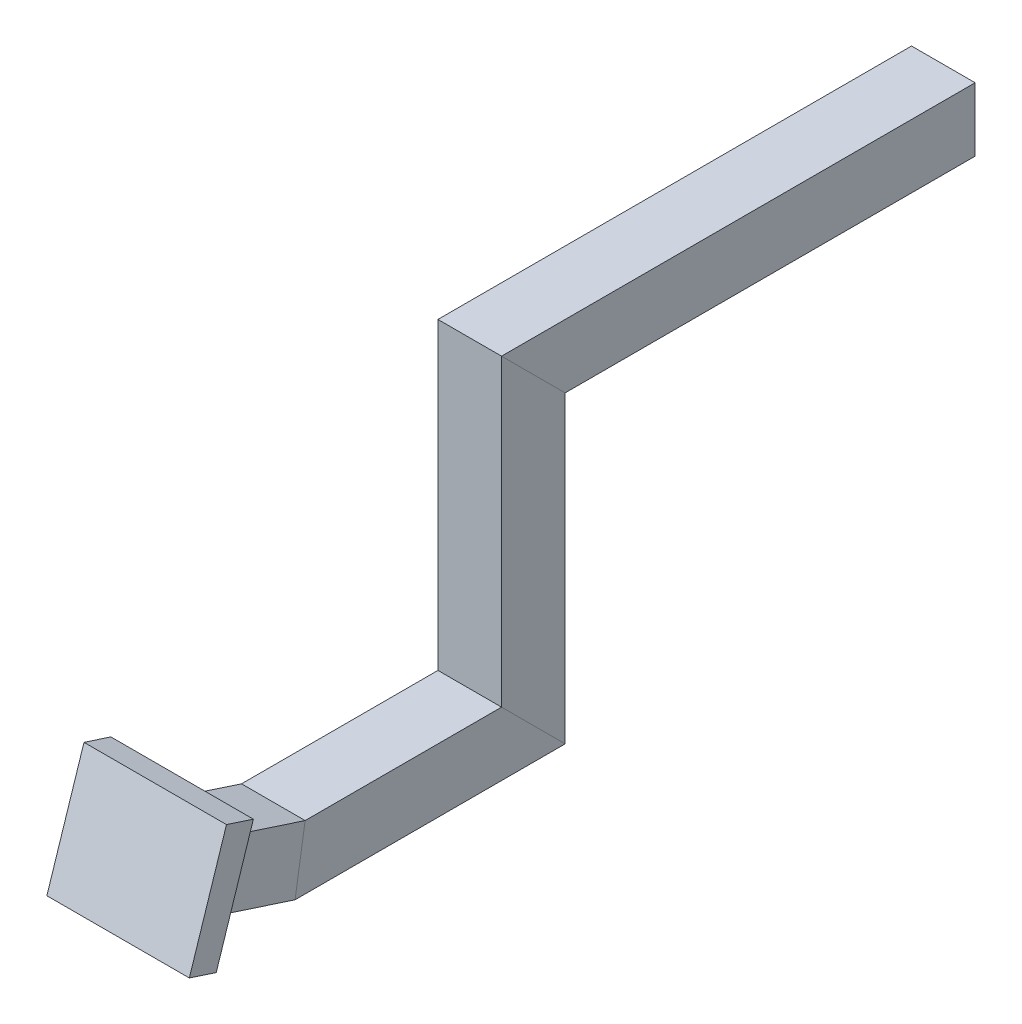
ISO-10303-21;
HEADER;
FILE_DESCRIPTION(('STEP AP214'),'2;1');
FILE_NAME('part.step','',(''),(''),'','','');
FILE_SCHEMA(('AUTOMOTIVE_DESIGN { 1 0 10303 214 1 1 1 1 }'));
ENDSEC;
DATA;
#1=APPLICATION_CONTEXT('core data for automotive mechanical design processes');
#2=APPLICATION_PROTOCOL_DEFINITION('international standard','automotive_design',2000,#1);
#3=PRODUCT_CONTEXT('',#1,'mechanical');
#4=PRODUCT('Part','Part','',(#3));
#5=PRODUCT_RELATED_PRODUCT_CATEGORY('part','',(#4));
#6=PRODUCT_DEFINITION_FORMATION('','',#4);
#7=PRODUCT_DEFINITION_CONTEXT('part definition',#1,'design');
#8=PRODUCT_DEFINITION('design','',#6,#7);
#9=PRODUCT_DEFINITION_SHAPE('','',#8);
#10=(LENGTH_UNIT() NAMED_UNIT(*) SI_UNIT(.MILLI.,.METRE.));
#11=(NAMED_UNIT(*) PLANE_ANGLE_UNIT() SI_UNIT($,.RADIAN.));
#12=(NAMED_UNIT(*) SI_UNIT($,.STERADIAN.) SOLID_ANGLE_UNIT());
#13=UNCERTAINTY_MEASURE_WITH_UNIT(LENGTH_MEASURE(1.E-05),#10,'distance_accuracy_value','');
#14=(GEOMETRIC_REPRESENTATION_CONTEXT(3) GLOBAL_UNCERTAINTY_ASSIGNED_CONTEXT((#13)) GLOBAL_UNIT_ASSIGNED_CONTEXT((#10,
#11,#12)) REPRESENTATION_CONTEXT('',''));
#15=CARTESIAN_POINT('',(0.,0.,0.));
#16=DIRECTION('',(0.,0.,1.));
#17=DIRECTION('',(1.,0.,0.));
#18=AXIS2_PLACEMENT_3D('',#15,#16,#17);
#19=CARTESIAN_POINT('',(125.720904946327,61.5947103502472,111.01473929286));
#20=DIRECTION('',(-1.,0.,0.));
#21=DIRECTION('',(0.,0.,1.));
#22=AXIS2_PLACEMENT_3D('',#19,#20,#21);
#23=PLANE('',#22);
#24=DIRECTION('',(0.,0.987688340595138,-0.156434465040228));
#25=VECTOR('',#24,1.);
#26=CARTESIAN_POINT('',(125.720904946327,67.8570534503429,111.619614546898));
#27=LINE('',#26,#25);
#28=CARTESIAN_POINT('',(125.720904946327,53.0881279706955,113.958782543186));
#29=VERTEX_POINT('',#28);
#30=CARTESIAN_POINT('',(125.720904946327,62.0881279706955,112.533322580265));
#31=VERTEX_POINT('',#30);
#32=EDGE_CURVE('E149',#29,#31,#27,.T.);
#33=ORIENTED_EDGE('',*,*,#32,.F.);
#34=DIRECTION('',(0.,0.309016994374942,0.951056516295155));
#35=VECTOR('',#34,1.);
#36=CARTESIAN_POINT('',(125.720904946327,53.0352017035908,113.795892242234));
#37=LINE('',#36,#35);
#38=CARTESIAN_POINT('',(125.720904946327,56.3985435911167,124.147194199365));
#39=VERTEX_POINT('',#38);
#40=EDGE_CURVE('E102',#29,#39,#37,.T.);
#41=ORIENTED_EDGE('',*,*,#40,.T.);
#42=DIRECTION('',(0.,-0.951056516295155,0.309016994374942));
#43=VECTOR('',#42,1.);
#44=CARTESIAN_POINT('',(125.720904946327,64.9580522377731,121.36604124999));
#45=LINE('',#44,#43);
#46=CARTESIAN_POINT('',(125.720904946327,64.9580522377731,121.36604124999));
#47=VERTEX_POINT('',#46);
#48=EDGE_CURVE('E153',#47,#39,#45,.T.);
#49=ORIENTED_EDGE('',*,*,#48,.F.);
#50=DIRECTION('',(0.,0.309016994374942,0.951056516295155));
#51=VECTOR('',#50,1.);
#52=CARTESIAN_POINT('',(125.720904946327,61.5947103502472,111.01473929286));
#53=LINE('',#52,#51);
#54=EDGE_CURVE('E45',#31,#47,#53,.T.);
#55=ORIENTED_EDGE('',*,*,#54,.F.);
#56=EDGE_LOOP('',(#33,#41,#49,#55));
#57=FACE_BOUND('',#56,.T.);
#58=ADVANCED_FACE('F41',(#57),#23,.T.);
#59=CARTESIAN_POINT('',(125.720904946327,53.0352017035908,113.795892242234));
#60=DIRECTION('',(0.,-0.951056516295155,0.309016994374942));
#61=DIRECTION('',(0.,-0.309016994374942,-0.951056516295155));
#62=AXIS2_PLACEMENT_3D('',#59,#60,#61);
#63=PLANE('',#62);
#64=DIRECTION('',(-1.,0.,0.));
#65=VECTOR('',#64,1.);
#66=CARTESIAN_POINT('',(125.720904946327,53.0881279706955,113.958782543186));
#67=LINE('',#66,#65);
#68=CARTESIAN_POINT('',(134.720904946327,53.0881279706955,113.958782543186));
#69=VERTEX_POINT('',#68);
#70=EDGE_CURVE('E93',#69,#29,#67,.T.);
#71=ORIENTED_EDGE('',*,*,#70,.F.);
#72=DIRECTION('',(0.,0.309016994374942,0.951056516295155));
#73=VECTOR('',#72,1.);
#74=CARTESIAN_POINT('',(134.720904946327,53.0352017035908,113.795892242234));
#75=LINE('',#74,#73);
#76=CARTESIAN_POINT('',(134.720904946327,57.6346115686165,127.951420264545));
#77=VERTEX_POINT('',#76);
#78=EDGE_CURVE('E98',#69,#77,#75,.T.);
#79=ORIENTED_EDGE('',*,*,#78,.T.);
#80=DIRECTION('',(1.,0.,0.));
#81=VECTOR('',#80,1.);
#82=CARTESIAN_POINT('',(118.72090346,57.6346115686165,127.951420264545));
#83=LINE('',#82,#81);
#84=CARTESIAN_POINT('',(118.72090346,57.6346115686165,127.951420264545));
#85=VERTEX_POINT('',#84);
#86=EDGE_CURVE('E191',#85,#77,#83,.T.);
#87=ORIENTED_EDGE('',*,*,#86,.F.);
#88=DIRECTION('',(0.,-0.309016994374943,-0.951056516295155));
#89=VECTOR('',#88,1.);
#90=CARTESIAN_POINT('',(118.72090346,57.6346115686165,127.951420264545));
#91=LINE('',#90,#89);
#92=CARTESIAN_POINT('',(118.72090346,56.3985435911167,124.147194199365));
#93=VERTEX_POINT('',#92);
#94=EDGE_CURVE('E196',#85,#93,#91,.T.);
#95=ORIENTED_EDGE('',*,*,#94,.T.);
#96=DIRECTION('',(1.,0.,0.));
#97=VECTOR('',#96,1.);
#98=CARTESIAN_POINT('',(118.72090346,56.3985435911167,124.147194199365));
#99=LINE('',#98,#97);
#100=EDGE_CURVE('E185',#93,#39,#99,.T.);
#101=ORIENTED_EDGE('',*,*,#100,.T.);
#102=ORIENTED_EDGE('',*,*,#40,.F.);
#103=EDGE_LOOP('',(#71,#79,#87,#95,#101,#102));
#104=FACE_BOUND('',#103,.T.);
#105=ADVANCED_FACE('F95',(#104),#63,.T.);
#106=CARTESIAN_POINT('',(134.720904946327,61.5947103502472,111.01473929286));
#107=DIRECTION('',(1.,0.,0.));
#108=DIRECTION('',(0.,0.,-1.));
#109=AXIS2_PLACEMENT_3D('',#106,#107,#108);
#110=PLANE('',#109);
#111=DIRECTION('',(0.,-0.987688340595138,0.156434465040228));
#112=VECTOR('',#111,1.);
#113=CARTESIAN_POINT('',(134.720904946327,67.8570534503429,111.619614546898));
#114=LINE('',#113,#112);
#115=CARTESIAN_POINT('',(134.720904946327,62.0881279706955,112.533322580265));
#116=VERTEX_POINT('',#115);
#117=EDGE_CURVE('E109',#116,#69,#114,.T.);
#118=ORIENTED_EDGE('',*,*,#117,.F.);
#119=DIRECTION('',(0.,0.309016994374942,0.951056516295155));
#120=VECTOR('',#119,1.);
#121=CARTESIAN_POINT('',(134.720904946327,61.5947103502472,111.01473929286));
#122=LINE('',#121,#120);
#123=CARTESIAN_POINT('',(134.720904946327,66.1941202152729,125.170267315171));
#124=VERTEX_POINT('',#123);
#125=EDGE_CURVE('E120',#116,#124,#122,.T.);
#126=ORIENTED_EDGE('',*,*,#125,.T.);
#127=DIRECTION('',(0.,0.951056516295155,-0.309016994374942));
#128=VECTOR('',#127,1.);
#129=CARTESIAN_POINT('',(134.720904946327,66.1941202152729,125.170267315171));
#130=LINE('',#129,#128);
#131=EDGE_CURVE('E117',#77,#124,#130,.T.);
#132=ORIENTED_EDGE('',*,*,#131,.F.);
#133=ORIENTED_EDGE('',*,*,#78,.F.);
#134=EDGE_LOOP('',(#118,#126,#132,#133));
#135=FACE_BOUND('',#134,.T.);
#136=ADVANCED_FACE('F113',(#135),#110,.T.);
#137=CARTESIAN_POINT('',(125.720904946327,61.5947103502472,111.01473929286));
#138=DIRECTION('',(0.,0.951056516295155,-0.309016994374942));
#139=DIRECTION('',(0.,0.309016994374942,0.951056516295155));
#140=AXIS2_PLACEMENT_3D('',#137,#138,#139);
#141=PLANE('',#140);
#142=DIRECTION('',(1.,0.,0.));
#143=VECTOR('',#142,1.);
#144=CARTESIAN_POINT('',(125.720904946327,62.0881279706955,112.533322580265));
#145=LINE('',#144,#143);
#146=EDGE_CURVE('E131',#31,#116,#145,.T.);
#147=ORIENTED_EDGE('',*,*,#146,.F.);
#148=ORIENTED_EDGE('',*,*,#54,.T.);
#149=DIRECTION('',(-1.,0.,0.));
#150=VECTOR('',#149,1.);
#151=CARTESIAN_POINT('',(118.72090346,64.9580522377731,121.36604124999));
#152=LINE('',#151,#150);
#153=CARTESIAN_POINT('',(118.72090346,64.9580522377731,121.36604124999));
#154=VERTEX_POINT('',#153);
#155=EDGE_CURVE('E171',#47,#154,#152,.T.);
#156=ORIENTED_EDGE('',*,*,#155,.T.);
#157=DIRECTION('',(0.,-0.309016994374943,-0.951056516295155));
#158=VECTOR('',#157,1.);
#159=CARTESIAN_POINT('',(118.72090346,66.1941202152729,125.170267315171));
#160=LINE('',#159,#158);
#161=CARTESIAN_POINT('',(118.72090346,66.1941202152729,125.170267315171));
#162=VERTEX_POINT('',#161);
#163=EDGE_CURVE('E157',#162,#154,#160,.T.);
#164=ORIENTED_EDGE('',*,*,#163,.F.);
#165=DIRECTION('',(-1.,0.,0.));
#166=VECTOR('',#165,1.);
#167=CARTESIAN_POINT('',(118.72090346,66.1941202152729,125.170267315171));
#168=LINE('',#167,#166);
#169=EDGE_CURVE('E400',#124,#162,#168,.T.);
#170=ORIENTED_EDGE('',*,*,#169,.F.);
#171=ORIENTED_EDGE('',*,*,#125,.F.);
#172=EDGE_LOOP('',(#147,#148,#156,#164,#170,#171));
#173=FACE_BOUND('',#172,.T.);
#174=ADVANCED_FACE('F43',(#173),#141,.T.);
#175=CARTESIAN_POINT('',(125.720904946327,62.0881279706955,75.1960525617259));
#176=DIRECTION('',(0.,1.,0.));
#177=DIRECTION('',(0.,0.,1.));
#178=AXIS2_PLACEMENT_3D('',#175,#176,#177);
#179=PLANE('',#178);
#180=DIRECTION('',(0.,0.,1.));
#181=VECTOR('',#180,1.);
#182=CARTESIAN_POINT('',(125.720904946327,62.0881279706955,75.1960525617259));
#183=LINE('',#182,#181);
#184=CARTESIAN_POINT('',(125.720904946327,62.0881279706955,84.7460525617259));
#185=VERTEX_POINT('',#184);
#186=EDGE_CURVE('E141',#185,#31,#183,.T.);
#187=ORIENTED_EDGE('',*,*,#186,.T.);
#188=ORIENTED_EDGE('',*,*,#146,.T.);
#189=DIRECTION('',(0.,0.,1.));
#190=VECTOR('',#189,1.);
#191=CARTESIAN_POINT('',(134.720904946327,62.0881279706955,75.1960525617259));
#192=LINE('',#191,#190);
#193=CARTESIAN_POINT('',(134.720904946327,62.0881279706955,84.7460525617259));
#194=VERTEX_POINT('',#193);
#195=EDGE_CURVE('E129',#194,#116,#192,.T.);
#196=ORIENTED_EDGE('',*,*,#195,.F.);
#197=DIRECTION('',(1.,0.,0.));
#198=VECTOR('',#197,1.);
#199=CARTESIAN_POINT('',(125.720904946327,62.0881279706955,84.7460525617259));
#200=LINE('',#199,#198);
#201=EDGE_CURVE('E250',#185,#194,#200,.T.);
#202=ORIENTED_EDGE('',*,*,#201,.F.);
#203=EDGE_LOOP('',(#187,#188,#196,#202));
#204=FACE_BOUND('',#203,.T.);
#205=ADVANCED_FACE('F273',(#204),#179,.T.);
#206=CARTESIAN_POINT('',(134.720904946327,62.0881279706955,75.1960525617259));
#207=DIRECTION('',(1.,0.,0.));
#208=DIRECTION('',(0.,0.,-1.));
#209=AXIS2_PLACEMENT_3D('',#206,#207,#208);
#210=PLANE('',#209);
#211=ORIENTED_EDGE('',*,*,#195,.T.);
#212=ORIENTED_EDGE('',*,*,#117,.T.);
#213=DIRECTION('',(0.,0.,1.));
#214=VECTOR('',#213,1.);
#215=CARTESIAN_POINT('',(134.720904946327,53.0881279706955,75.1960525617259));
#216=LINE('',#215,#214);
#217=CARTESIAN_POINT('',(134.720904946327,53.0881279706955,75.7460525617259));
#218=VERTEX_POINT('',#217);
#219=EDGE_CURVE('E126',#218,#69,#216,.T.);
#220=ORIENTED_EDGE('',*,*,#219,.F.);
#221=DIRECTION('',(0.,-0.707106781186548,-0.707106781186548));
#222=VECTOR('',#221,1.);
#223=CARTESIAN_POINT('',(134.720904946327,83.8631279706955,106.521052561726));
#224=LINE('',#223,#222);
#225=EDGE_CURVE('E247',#194,#218,#224,.T.);
#226=ORIENTED_EDGE('',*,*,#225,.F.);
#227=EDGE_LOOP('',(#211,#212,#220,#226));
#228=FACE_BOUND('',#227,.T.);
#229=ADVANCED_FACE('F125',(#228),#210,.T.);
#230=CARTESIAN_POINT('',(125.720904946327,53.0881279706955,75.1960525617259));
#231=DIRECTION('',(0.,-1.,0.));
#232=DIRECTION('',(0.,0.,-1.));
#233=AXIS2_PLACEMENT_3D('',#230,#231,#232);
#234=PLANE('',#233);
#235=ORIENTED_EDGE('',*,*,#219,.T.);
#236=ORIENTED_EDGE('',*,*,#70,.T.);
#237=DIRECTION('',(0.,0.,1.));
#238=VECTOR('',#237,1.);
#239=CARTESIAN_POINT('',(125.720904946327,53.0881279706955,75.1960525617259));
#240=LINE('',#239,#238);
#241=CARTESIAN_POINT('',(125.720904946327,53.0881279706955,75.7460525617259));
#242=VERTEX_POINT('',#241);
#243=EDGE_CURVE('E137',#242,#29,#240,.T.);
#244=ORIENTED_EDGE('',*,*,#243,.F.);
#245=DIRECTION('',(-1.,0.,0.));
#246=VECTOR('',#245,1.);
#247=CARTESIAN_POINT('',(125.720904946327,53.0881279706955,75.7460525617259));
#248=LINE('',#247,#246);
#249=EDGE_CURVE('E135',#218,#242,#248,.T.);
#250=ORIENTED_EDGE('',*,*,#249,.F.);
#251=EDGE_LOOP('',(#235,#236,#244,#250));
#252=FACE_BOUND('',#251,.T.);
#253=ADVANCED_FACE('F133',(#252),#234,.T.);
#254=CARTESIAN_POINT('',(125.720904946327,62.0881279706955,75.1960525617259));
#255=DIRECTION('',(-1.,0.,0.));
#256=DIRECTION('',(0.,0.,1.));
#257=AXIS2_PLACEMENT_3D('',#254,#255,#256);
#258=PLANE('',#257);
#259=ORIENTED_EDGE('',*,*,#243,.T.);
#260=ORIENTED_EDGE('',*,*,#32,.T.);
#261=ORIENTED_EDGE('',*,*,#186,.F.);
#262=DIRECTION('',(0.,0.707106781186548,0.707106781186548));
#263=VECTOR('',#262,1.);
#264=CARTESIAN_POINT('',(125.720904946327,83.8631279706955,106.521052561726));
#265=LINE('',#264,#263);
#266=EDGE_CURVE('E254',#242,#185,#265,.T.);
#267=ORIENTED_EDGE('',*,*,#266,.F.);
#268=EDGE_LOOP('',(#259,#260,#261,#267));
#269=FACE_BOUND('',#268,.T.);
#270=ADVANCED_FACE('F276',(#269),#258,.T.);
#271=CARTESIAN_POINT('',(125.720904946327,105.638127970695,84.7460525617259));
#272=DIRECTION('',(0.,0.,1.));
#273=DIRECTION('',(1.,0.,0.));
#274=AXIS2_PLACEMENT_3D('',#271,#272,#273);
#275=PLANE('',#274);
#276=DIRECTION('',(0.,-1.,0.));
#277=VECTOR('',#276,1.);
#278=CARTESIAN_POINT('',(125.720904946327,105.638127970695,84.7460525617259));
#279=LINE('',#278,#277);
#280=CARTESIAN_POINT('',(125.720904946327,105.088127970695,84.7460525617259));
#281=VERTEX_POINT('',#280);
#282=EDGE_CURVE('E265',#281,#185,#279,.T.);
#283=ORIENTED_EDGE('',*,*,#282,.T.);
#284=ORIENTED_EDGE('',*,*,#201,.T.);
#285=DIRECTION('',(0.,-1.,0.));
#286=VECTOR('',#285,1.);
#287=CARTESIAN_POINT('',(134.720904946327,105.638127970695,84.7460525617259));
#288=LINE('',#287,#286);
#289=CARTESIAN_POINT('',(134.720904946327,105.088127970695,84.7460525617259));
#290=VERTEX_POINT('',#289);
#291=EDGE_CURVE('E108',#290,#194,#288,.T.);
#292=ORIENTED_EDGE('',*,*,#291,.F.);
#293=DIRECTION('',(1.,0.,0.));
#294=VECTOR('',#293,1.);
#295=CARTESIAN_POINT('',(125.720904946327,105.088127970695,84.7460525617259));
#296=LINE('',#295,#294);
#297=EDGE_CURVE('E205',#281,#290,#296,.T.);
#298=ORIENTED_EDGE('',*,*,#297,.F.);
#299=EDGE_LOOP('',(#283,#284,#292,#298));
#300=FACE_BOUND('',#299,.T.);
#301=ADVANCED_FACE('F283',(#300),#275,.T.);
#302=CARTESIAN_POINT('',(134.720904946327,105.638127970695,84.7460525617259));
#303=DIRECTION('',(1.,0.,0.));
#304=DIRECTION('',(0.,0.,-1.));
#305=AXIS2_PLACEMENT_3D('',#302,#303,#304);
#306=PLANE('',#305);
#307=ORIENTED_EDGE('',*,*,#291,.T.);
#308=ORIENTED_EDGE('',*,*,#225,.T.);
#309=DIRECTION('',(0.,-1.,0.));
#310=VECTOR('',#309,1.);
#311=CARTESIAN_POINT('',(134.720904946327,105.638127970695,75.7460525617259));
#312=LINE('',#311,#310);
#313=CARTESIAN_POINT('',(134.720904946327,96.0881279706955,75.7460525617259));
#314=VERTEX_POINT('',#313);
#315=EDGE_CURVE('E258',#314,#218,#312,.T.);
#316=ORIENTED_EDGE('',*,*,#315,.F.);
#317=DIRECTION('',(0.,-0.707106781186548,-0.707106781186548));
#318=VECTOR('',#317,1.);
#319=CARTESIAN_POINT('',(134.720904946327,71.5901057056955,51.2480302967259));
#320=LINE('',#319,#318);
#321=EDGE_CURVE('E52',#290,#314,#320,.T.);
#322=ORIENTED_EDGE('',*,*,#321,.F.);
#323=EDGE_LOOP('',(#307,#308,#316,#322));
#324=FACE_BOUND('',#323,.T.);
#325=ADVANCED_FACE('F438',(#324),#306,.T.);
#326=CARTESIAN_POINT('',(125.720904946327,105.638127970695,75.7460525617259));
#327=DIRECTION('',(0.,0.,-1.));
#328=DIRECTION('',(-1.,0.,0.));
#329=AXIS2_PLACEMENT_3D('',#326,#327,#328);
#330=PLANE('',#329);
#331=ORIENTED_EDGE('',*,*,#315,.T.);
#332=ORIENTED_EDGE('',*,*,#249,.T.);
#333=DIRECTION('',(0.,-1.,0.));
#334=VECTOR('',#333,1.);
#335=CARTESIAN_POINT('',(125.720904946327,105.638127970695,75.7460525617259));
#336=LINE('',#335,#334);
#337=CARTESIAN_POINT('',(125.720904946327,96.0881279706955,75.7460525617259));
#338=VERTEX_POINT('',#337);
#339=EDGE_CURVE('E261',#338,#242,#336,.T.);
#340=ORIENTED_EDGE('',*,*,#339,.F.);
#341=DIRECTION('',(-1.,0.,0.));
#342=VECTOR('',#341,1.);
#343=CARTESIAN_POINT('',(125.720904946327,96.0881279706955,75.7460525617259));
#344=LINE('',#343,#342);
#345=EDGE_CURVE('E11',#314,#338,#344,.T.);
#346=ORIENTED_EDGE('',*,*,#345,.F.);
#347=EDGE_LOOP('',(#331,#332,#340,#346));
#348=FACE_BOUND('',#347,.T.);
#349=ADVANCED_FACE('F435',(#348),#330,.T.);
#350=CARTESIAN_POINT('',(125.720904946327,105.638127970695,84.7460525617259));
#351=DIRECTION('',(-1.,0.,0.));
#352=DIRECTION('',(0.,0.,1.));
#353=AXIS2_PLACEMENT_3D('',#350,#351,#352);
#354=PLANE('',#353);
#355=ORIENTED_EDGE('',*,*,#339,.T.);
#356=ORIENTED_EDGE('',*,*,#266,.T.);
#357=ORIENTED_EDGE('',*,*,#282,.F.);
#358=DIRECTION('',(0.,0.707106781186548,0.707106781186548));
#359=VECTOR('',#358,1.);
#360=CARTESIAN_POINT('',(125.720904946327,71.5901057056955,51.2480302967259));
#361=LINE('',#360,#359);
#362=EDGE_CURVE('E209',#338,#281,#361,.T.);
#363=ORIENTED_EDGE('',*,*,#362,.F.);
#364=EDGE_LOOP('',(#355,#356,#357,#363));
#365=FACE_BOUND('',#364,.T.);
#366=ADVANCED_FACE('F279',(#365),#354,.T.);
#367=CARTESIAN_POINT('',(125.720904946327,105.088127970695,17.7500080317259));
#368=DIRECTION('',(0.,1.,0.));
#369=DIRECTION('',(0.,0.,1.));
#370=AXIS2_PLACEMENT_3D('',#367,#368,#369);
#371=PLANE('',#370);
#372=DIRECTION('',(0.,0.,1.));
#373=VECTOR('',#372,1.);
#374=CARTESIAN_POINT('',(125.720904946327,105.088127970695,17.7500080317259));
#375=LINE('',#374,#373);
#376=CARTESIAN_POINT('',(125.720904946327,105.088127970695,17.7500080317259));
#377=VERTEX_POINT('',#376);
#378=EDGE_CURVE('E220',#377,#281,#375,.T.);
#379=ORIENTED_EDGE('',*,*,#378,.T.);
#380=ORIENTED_EDGE('',*,*,#297,.T.);
#381=DIRECTION('',(0.,0.,1.));
#382=VECTOR('',#381,1.);
#383=CARTESIAN_POINT('',(134.720904946327,105.088127970695,17.7500080317259));
#384=LINE('',#383,#382);
#385=CARTESIAN_POINT('',(134.720904946327,105.088127970695,17.7500080317259));
#386=VERTEX_POINT('',#385);
#387=EDGE_CURVE('E232',#386,#290,#384,.T.);
#388=ORIENTED_EDGE('',*,*,#387,.F.);
#389=DIRECTION('',(-1.,0.,0.));
#390=VECTOR('',#389,1.);
#391=CARTESIAN_POINT('',(125.720904946327,105.088127970695,17.7500080317259));
#392=LINE('',#391,#390);
#393=EDGE_CURVE('E224',#386,#377,#392,.T.);
#394=ORIENTED_EDGE('',*,*,#393,.T.);
#395=EDGE_LOOP('',(#379,#380,#388,#394));
#396=FACE_BOUND('',#395,.T.);
#397=ADVANCED_FACE('F288',(#396),#371,.T.);
#398=CARTESIAN_POINT('',(134.720904946327,105.088127970695,17.7500080317259));
#399=DIRECTION('',(1.,0.,0.));
#400=DIRECTION('',(0.,0.,-1.));
#401=AXIS2_PLACEMENT_3D('',#398,#399,#400);
#402=PLANE('',#401);
#403=ORIENTED_EDGE('',*,*,#387,.T.);
#404=ORIENTED_EDGE('',*,*,#321,.T.);
#405=DIRECTION('',(0.,0.,1.));
#406=VECTOR('',#405,1.);
#407=CARTESIAN_POINT('',(134.720904946327,96.0881279706955,17.7500080317259));
#408=LINE('',#407,#406);
#409=CARTESIAN_POINT('',(134.720904946327,96.0881279706955,17.7500080317259));
#410=VERTEX_POINT('',#409);
#411=EDGE_CURVE('E219',#410,#314,#408,.T.);
#412=ORIENTED_EDGE('',*,*,#411,.F.);
#413=DIRECTION('',(0.,1.,0.));
#414=VECTOR('',#413,1.);
#415=CARTESIAN_POINT('',(134.720904946327,105.088127970695,17.7500080317259));
#416=LINE('',#415,#414);
#417=EDGE_CURVE('E228',#410,#386,#416,.T.);
#418=ORIENTED_EDGE('',*,*,#417,.T.);
#419=EDGE_LOOP('',(#403,#404,#412,#418));
#420=FACE_BOUND('',#419,.T.);
#421=ADVANCED_FACE('F292',(#420),#402,.T.);
#422=CARTESIAN_POINT('',(125.720904946327,96.0881279706955,17.7500080317259));
#423=DIRECTION('',(0.,-1.,0.));
#424=DIRECTION('',(0.,0.,-1.));
#425=AXIS2_PLACEMENT_3D('',#422,#423,#424);
#426=PLANE('',#425);
#427=ORIENTED_EDGE('',*,*,#411,.T.);
#428=ORIENTED_EDGE('',*,*,#345,.T.);
#429=DIRECTION('',(0.,0.,1.));
#430=VECTOR('',#429,1.);
#431=CARTESIAN_POINT('',(125.720904946327,96.0881279706955,17.7500080317259));
#432=LINE('',#431,#430);
#433=CARTESIAN_POINT('',(125.720904946327,96.0881279706955,17.7500080317259));
#434=VERTEX_POINT('',#433);
#435=EDGE_CURVE('E215',#434,#338,#432,.T.);
#436=ORIENTED_EDGE('',*,*,#435,.F.);
#437=DIRECTION('',(1.,0.,0.));
#438=VECTOR('',#437,1.);
#439=CARTESIAN_POINT('',(125.720904946327,96.0881279706955,17.7500080317259));
#440=LINE('',#439,#438);
#441=EDGE_CURVE('E214',#434,#410,#440,.T.);
#442=ORIENTED_EDGE('',*,*,#441,.T.);
#443=EDGE_LOOP('',(#427,#428,#436,#442));
#444=FACE_BOUND('',#443,.T.);
#445=ADVANCED_FACE('F307',(#444),#426,.T.);
#446=CARTESIAN_POINT('',(125.720904946327,105.088127970695,17.7500080317259));
#447=DIRECTION('',(-1.,0.,0.));
#448=DIRECTION('',(0.,0.,1.));
#449=AXIS2_PLACEMENT_3D('',#446,#447,#448);
#450=PLANE('',#449);
#451=ORIENTED_EDGE('',*,*,#435,.T.);
#452=ORIENTED_EDGE('',*,*,#362,.T.);
#453=ORIENTED_EDGE('',*,*,#378,.F.);
#454=DIRECTION('',(0.,-1.,0.));
#455=VECTOR('',#454,1.);
#456=CARTESIAN_POINT('',(125.720904946327,105.088127970695,17.7500080317259));
#457=LINE('',#456,#455);
#458=EDGE_CURVE('E210',#377,#434,#457,.T.);
#459=ORIENTED_EDGE('',*,*,#458,.T.);
#460=EDGE_LOOP('',(#451,#452,#453,#459));
#461=FACE_BOUND('',#460,.T.);
#462=ADVANCED_FACE('F310',(#461),#450,.T.);
#463=CARTESIAN_POINT('',(0.,41.8715266158908,128.867308142125));
#464=DIRECTION('',(0.,0.309016994374942,0.951056516295155));
#465=DIRECTION('',(0.,-0.951056516295155,0.309016994374942));
#466=AXIS2_PLACEMENT_3D('',#463,#464,#465);
#467=PLANE('',#466);
#468=ORIENTED_EDGE('',*,*,#155,.F.);
#469=ORIENTED_EDGE('',*,*,#48,.T.);
#470=ORIENTED_EDGE('',*,*,#100,.F.);
#471=DIRECTION('',(0.,-0.951056516295155,0.309016994374942));
#472=VECTOR('',#471,1.);
#473=CARTESIAN_POINT('',(118.72090346,64.9580522377731,121.36604124999));
#474=LINE('',#473,#472);
#475=EDGE_CURVE('E179',#154,#93,#474,.T.);
#476=ORIENTED_EDGE('',*,*,#475,.F.);
#477=EDGE_LOOP('',(#468,#469,#470,#476));
#478=FACE_BOUND('',#477,.T.);
#479=ADVANCED_FACE('F176',(#478),#467,.F.);
#480=CARTESIAN_POINT('',(118.72090346,66.1941202152729,125.170267315171));
#481=DIRECTION('',(1.,0.,0.));
#482=DIRECTION('',(0.,0.,-1.));
#483=AXIS2_PLACEMENT_3D('',#480,#481,#482);
#484=PLANE('',#483);
#485=ORIENTED_EDGE('',*,*,#475,.T.);
#486=ORIENTED_EDGE('',*,*,#94,.F.);
#487=DIRECTION('',(0.,-0.951056516295155,0.309016994374942));
#488=VECTOR('',#487,1.);
#489=CARTESIAN_POINT('',(118.72090346,66.1941202152729,125.170267315171));
#490=LINE('',#489,#488);
#491=EDGE_CURVE('E403',#162,#85,#490,.T.);
#492=ORIENTED_EDGE('',*,*,#491,.F.);
#493=ORIENTED_EDGE('',*,*,#163,.T.);
#494=EDGE_LOOP('',(#485,#486,#492,#493));
#495=FACE_BOUND('',#494,.T.);
#496=ADVANCED_FACE('F412',(#495),#484,.F.);
#497=CARTESIAN_POINT('',(138.798850466694,71.2344142576508,127.73842540295));
#498=DIRECTION('',(-1.,0.,0.));
#499=DIRECTION('',(0.,0.,1.));
#500=AXIS2_PLACEMENT_3D('',#497,#498,#499);
#501=PLANE('',#500);
#502=DIRECTION('',(0.,0.951056516295155,-0.309016994374943));
#503=VECTOR('',#502,1.);
#504=CARTESIAN_POINT('',(138.798850466694,69.998346280151,123.934199337769));
#505=LINE('',#504,#503);
#506=CARTESIAN_POINT('',(138.798850466694,53.8303855031334,129.187488242143));
#507=VERTEX_POINT('',#506);
#508=CARTESIAN_POINT('',(138.798850466694,69.998346280151,123.934199337769));
#509=VERTEX_POINT('',#508);
#510=EDGE_CURVE('E373',#507,#509,#505,.T.);
#511=ORIENTED_EDGE('',*,*,#510,.T.);
#512=DIRECTION('',(0.,-0.309016994374943,-0.951056516295155));
#513=VECTOR('',#512,1.);
#514=CARTESIAN_POINT('',(138.798850466694,71.2344142576508,127.73842540295));
#515=LINE('',#514,#513);
#516=CARTESIAN_POINT('',(138.798850466694,71.2344142576508,127.73842540295));
#517=VERTEX_POINT('',#516);
#518=EDGE_CURVE('E181',#517,#509,#515,.T.);
#519=ORIENTED_EDGE('',*,*,#518,.F.);
#520=DIRECTION('',(0.,0.951056516295155,-0.309016994374943));
#521=VECTOR('',#520,1.);
#522=CARTESIAN_POINT('',(138.798850466694,71.2344142576508,127.73842540295));
#523=LINE('',#522,#521);
#524=CARTESIAN_POINT('',(138.798850466694,55.0664534806332,132.991714307324));
#525=VERTEX_POINT('',#524);
#526=EDGE_CURVE('E359',#525,#517,#523,.T.);
#527=ORIENTED_EDGE('',*,*,#526,.F.);
#528=DIRECTION('',(0.,-0.309016994374943,-0.951056516295155));
#529=VECTOR('',#528,1.);
#530=CARTESIAN_POINT('',(138.798850466694,55.0664534806332,132.991714307324));
#531=LINE('',#530,#529);
#532=EDGE_CURVE('E374',#525,#507,#531,.T.);
#533=ORIENTED_EDGE('',*,*,#532,.T.);
#534=EDGE_LOOP('',(#511,#519,#527,#533));
#535=FACE_BOUND('',#534,.T.);
#536=ADVANCED_FACE('F371',(#535),#501,.F.);
#537=CARTESIAN_POINT('',(118.642959433306,71.2344142576508,127.73842540295));
#538=DIRECTION('',(0.,-0.951056516295155,0.309016994374943));
#539=DIRECTION('',(0.,-0.309016994374943,-0.951056516295155));
#540=AXIS2_PLACEMENT_3D('',#537,#538,#539);
#541=PLANE('',#540);
#542=DIRECTION('',(-1.,0.,0.));
#543=VECTOR('',#542,1.);
#544=CARTESIAN_POINT('',(118.642959433306,69.998346280151,123.934199337769));
#545=LINE('',#544,#543);
#546=CARTESIAN_POINT('',(118.642959433306,69.998346280151,123.934199337769));
#547=VERTEX_POINT('',#546);
#548=EDGE_CURVE('E378',#509,#547,#545,.T.);
#549=ORIENTED_EDGE('',*,*,#548,.T.);
#550=DIRECTION('',(0.,-0.309016994374943,-0.951056516295155));
#551=VECTOR('',#550,1.);
#552=CARTESIAN_POINT('',(118.642959433306,71.2344142576508,127.73842540295));
#553=LINE('',#552,#551);
#554=CARTESIAN_POINT('',(118.642959433306,71.2344142576508,127.73842540295));
#555=VERTEX_POINT('',#554);
#556=EDGE_CURVE('E188',#555,#547,#553,.T.);
#557=ORIENTED_EDGE('',*,*,#556,.F.);
#558=DIRECTION('',(-1.,0.,0.));
#559=VECTOR('',#558,1.);
#560=CARTESIAN_POINT('',(118.642959433306,71.2344142576508,127.73842540295));
#561=LINE('',#560,#559);
#562=EDGE_CURVE('E349',#517,#555,#561,.T.);
#563=ORIENTED_EDGE('',*,*,#562,.F.);
#564=ORIENTED_EDGE('',*,*,#518,.T.);
#565=EDGE_LOOP('',(#549,#557,#563,#564));
#566=FACE_BOUND('',#565,.T.);
#567=ADVANCED_FACE('F351',(#566),#541,.F.);
#568=CARTESIAN_POINT('',(118.642959433306,71.2344142576508,127.73842540295));
#569=DIRECTION('',(1.,0.,0.));
#570=DIRECTION('',(0.,0.,-1.));
#571=AXIS2_PLACEMENT_3D('',#568,#569,#570);
#572=PLANE('',#571);
#573=DIRECTION('',(0.,-0.951056516295155,0.309016994374943));
#574=VECTOR('',#573,1.);
#575=CARTESIAN_POINT('',(118.642959433306,69.998346280151,123.934199337769));
#576=LINE('',#575,#574);
#577=CARTESIAN_POINT('',(118.642959433306,53.8303855031334,129.187488242143));
#578=VERTEX_POINT('',#577);
#579=EDGE_CURVE('E381',#547,#578,#576,.T.);
#580=ORIENTED_EDGE('',*,*,#579,.T.);
#581=DIRECTION('',(0.,-0.309016994374943,-0.951056516295155));
#582=VECTOR('',#581,1.);
#583=CARTESIAN_POINT('',(118.642959433306,55.0664534806332,132.991714307324));
#584=LINE('',#583,#582);
#585=CARTESIAN_POINT('',(118.642959433306,55.0664534806332,132.991714307324));
#586=VERTEX_POINT('',#585);
#587=EDGE_CURVE('E392',#586,#578,#584,.T.);
#588=ORIENTED_EDGE('',*,*,#587,.F.);
#589=DIRECTION('',(0.,-0.951056516295155,0.309016994374943));
#590=VECTOR('',#589,1.);
#591=CARTESIAN_POINT('',(118.642959433306,71.2344142576508,127.73842540295));
#592=LINE('',#591,#590);
#593=EDGE_CURVE('E358',#555,#586,#592,.T.);
#594=ORIENTED_EDGE('',*,*,#593,.F.);
#595=ORIENTED_EDGE('',*,*,#556,.T.);
#596=EDGE_LOOP('',(#580,#588,#594,#595));
#597=FACE_BOUND('',#596,.T.);
#598=ADVANCED_FACE('F540',(#597),#572,.F.);
#599=CARTESIAN_POINT('',(118.642959433306,55.0664534806332,132.991714307324));
#600=DIRECTION('',(0.,0.951056516295155,-0.309016994374943));
#601=DIRECTION('',(0.,0.309016994374943,0.951056516295155));
#602=AXIS2_PLACEMENT_3D('',#599,#600,#601);
#603=PLANE('',#602);
#604=DIRECTION('',(1.,0.,0.));
#605=VECTOR('',#604,1.);
#606=CARTESIAN_POINT('',(118.642959433306,53.8303855031334,129.187488242143));
#607=LINE('',#606,#605);
#608=EDGE_CURVE('E369',#578,#507,#607,.T.);
#609=ORIENTED_EDGE('',*,*,#608,.T.);
#610=ORIENTED_EDGE('',*,*,#532,.F.);
#611=DIRECTION('',(1.,0.,0.));
#612=VECTOR('',#611,1.);
#613=CARTESIAN_POINT('',(118.642959433306,55.0664534806332,132.991714307324));
#614=LINE('',#613,#612);
#615=EDGE_CURVE('E364',#586,#525,#614,.T.);
#616=ORIENTED_EDGE('',*,*,#615,.F.);
#617=ORIENTED_EDGE('',*,*,#587,.T.);
#618=EDGE_LOOP('',(#609,#610,#616,#617));
#619=FACE_BOUND('',#618,.T.);
#620=ADVANCED_FACE('F533',(#619),#603,.F.);
#621=CARTESIAN_POINT('',(0.,44.3436625708905,136.475760272486));
#622=DIRECTION('',(0.,0.309016994374943,0.951056516295155));
#623=DIRECTION('',(0.,-0.951056516295155,0.309016994374943));
#624=AXIS2_PLACEMENT_3D('',#621,#622,#623);
#625=PLANE('',#624);
#626=ORIENTED_EDGE('',*,*,#526,.T.);
#627=ORIENTED_EDGE('',*,*,#562,.T.);
#628=ORIENTED_EDGE('',*,*,#593,.T.);
#629=ORIENTED_EDGE('',*,*,#615,.T.);
#630=EDGE_LOOP('',(#626,#627,#628,#629));
#631=FACE_BOUND('',#630,.T.);
#632=ADVANCED_FACE('F362',(#631),#625,.T.);
#633=CARTESIAN_POINT('',(0.,43.1075945933907,132.671534207306));
#634=DIRECTION('',(0.,0.309016994374943,0.951056516295155));
#635=DIRECTION('',(0.,-0.951056516295155,0.309016994374943));
#636=AXIS2_PLACEMENT_3D('',#633,#634,#635);
#637=PLANE('',#636);
#638=ORIENTED_EDGE('',*,*,#86,.T.);
#639=ORIENTED_EDGE('',*,*,#131,.T.);
#640=ORIENTED_EDGE('',*,*,#169,.T.);
#641=ORIENTED_EDGE('',*,*,#491,.T.);
#642=EDGE_LOOP('',(#638,#639,#640,#641));
#643=FACE_BOUND('',#642,.T.);
#644=ORIENTED_EDGE('',*,*,#510,.F.);
#645=ORIENTED_EDGE('',*,*,#608,.F.);
#646=ORIENTED_EDGE('',*,*,#579,.F.);
#647=ORIENTED_EDGE('',*,*,#548,.F.);
#648=EDGE_LOOP('',(#644,#645,#646,#647));
#649=FACE_BOUND('',#648,.T.);
#650=ADVANCED_FACE('F409',(#643,#649),#637,.F.);
#651=CARTESIAN_POINT('',(150.220903456211,115.588128566742,17.7500080317259));
#652=DIRECTION('',(0.,0.,-1.));
#653=DIRECTION('',(-1.,0.,0.));
#654=AXIS2_PLACEMENT_3D('',#651,#652,#653);
#655=PLANE('',#654);
#656=ORIENTED_EDGE('',*,*,#417,.F.);
#657=ORIENTED_EDGE('',*,*,#441,.F.);
#658=ORIENTED_EDGE('',*,*,#458,.F.);
#659=ORIENTED_EDGE('',*,*,#393,.F.);
#660=EDGE_LOOP('',(#656,#657,#658,#659));
#661=FACE_BOUND('',#660,.T.);
#662=ADVANCED_FACE('F301',(#661),#655,.T.);
#663=CLOSED_SHELL('',(#58,#105,#136,#174,#205,#229,#253,#270,#301,#325,#349,#366,#397,#421,#445,
#462,#479,#496,#536,#567,#598,#620,#632,#650,#662));
#664=MANIFOLD_SOLID_BREP('B2',#663);
#665=ADVANCED_BREP_SHAPE_REPRESENTATION('',(#18,#664),#14);
#666=SHAPE_DEFINITION_REPRESENTATION(#9,#665);
ENDSEC;
END-ISO-10303-21;
